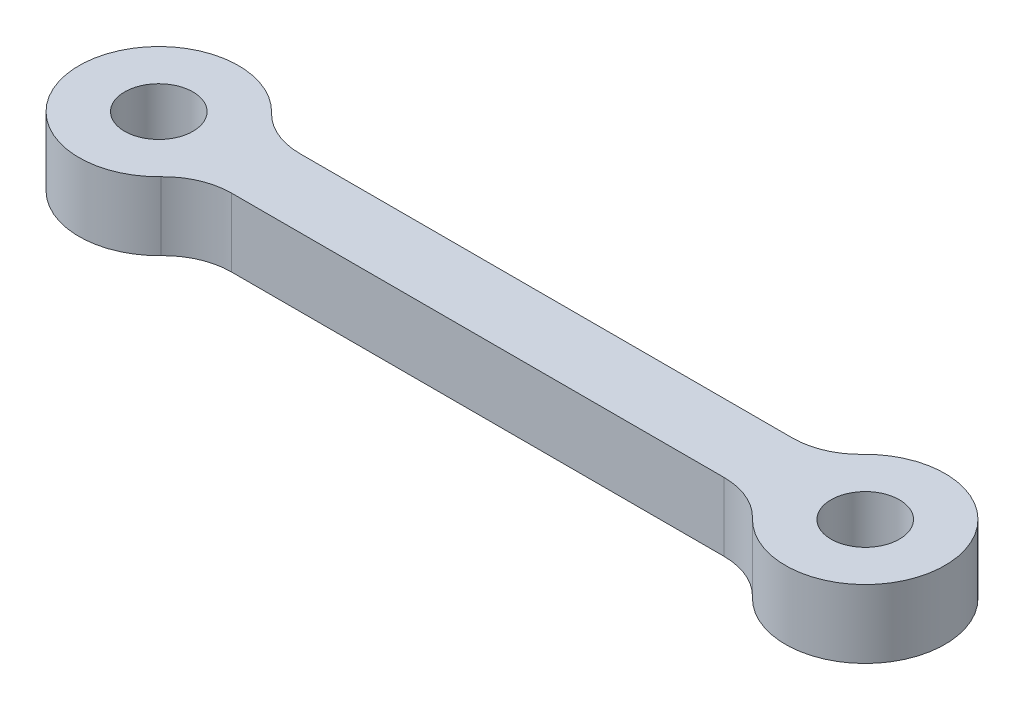
ISO-10303-21;
HEADER;
FILE_DESCRIPTION(('STEP AP214'),'2;1');
FILE_NAME('part.step','',(''),(''),'','','');
FILE_SCHEMA(('AUTOMOTIVE_DESIGN { 1 0 10303 214 1 1 1 1 }'));
ENDSEC;
DATA;
#1=APPLICATION_CONTEXT('core data for automotive mechanical design processes');
#2=APPLICATION_PROTOCOL_DEFINITION('international standard','automotive_design',2000,#1);
#3=PRODUCT_CONTEXT('',#1,'mechanical');
#4=PRODUCT('Part','Part','',(#3));
#5=PRODUCT_RELATED_PRODUCT_CATEGORY('part','',(#4));
#6=PRODUCT_DEFINITION_FORMATION('','',#4);
#7=PRODUCT_DEFINITION_CONTEXT('part definition',#1,'design');
#8=PRODUCT_DEFINITION('design','',#6,#7);
#9=PRODUCT_DEFINITION_SHAPE('','',#8);
#10=(LENGTH_UNIT() NAMED_UNIT(*) SI_UNIT(.MILLI.,.METRE.));
#11=(NAMED_UNIT(*) PLANE_ANGLE_UNIT() SI_UNIT($,.RADIAN.));
#12=(NAMED_UNIT(*) SI_UNIT($,.STERADIAN.) SOLID_ANGLE_UNIT());
#13=UNCERTAINTY_MEASURE_WITH_UNIT(LENGTH_MEASURE(1.E-05),#10,'distance_accuracy_value','');
#14=(GEOMETRIC_REPRESENTATION_CONTEXT(3) GLOBAL_UNCERTAINTY_ASSIGNED_CONTEXT((#13)) GLOBAL_UNIT_ASSIGNED_CONTEXT((#10,
#11,#12)) REPRESENTATION_CONTEXT('',''));
#15=CARTESIAN_POINT('',(0.,0.,0.));
#16=DIRECTION('',(0.,0.,1.));
#17=DIRECTION('',(1.,0.,0.));
#18=AXIS2_PLACEMENT_3D('',#15,#16,#17);
#19=CARTESIAN_POINT('',(0.,1.5,-1.5));
#20=DIRECTION('',(0.,0.,-1.));
#21=DIRECTION('',(-1.,0.,0.));
#22=AXIS2_PLACEMENT_3D('',#19,#20,#21);
#23=PLANE('',#22);
#24=DIRECTION('',(1.,0.,0.));
#25=VECTOR('',#24,1.);
#26=CARTESIAN_POINT('',(0.,-1.5,-1.5));
#27=LINE('',#26,#25);
#28=CARTESIAN_POINT('',(-10.8095842401766,-1.5,-1.5));
#29=VERTEX_POINT('',#28);
#30=CARTESIAN_POINT('',(10.8095842401766,-1.5,-1.5));
#31=VERTEX_POINT('',#30);
#32=EDGE_CURVE('E123',#29,#31,#27,.T.);
#33=ORIENTED_EDGE('',*,*,#32,.F.);
#34=DIRECTION('',(0.,-1.,0.));
#35=VECTOR('',#34,1.);
#36=CARTESIAN_POINT('',(-10.8095842401766,1.5,-1.5));
#37=LINE('',#36,#35);
#38=CARTESIAN_POINT('',(-10.8095842401766,1.5,-1.5));
#39=VERTEX_POINT('',#38);
#40=EDGE_CURVE('E102',#29,#39,#37,.F.);
#41=ORIENTED_EDGE('',*,*,#40,.T.);
#42=DIRECTION('',(1.,0.,0.));
#43=VECTOR('',#42,1.);
#44=CARTESIAN_POINT('',(0.,1.5,-1.5));
#45=LINE('',#44,#43);
#46=CARTESIAN_POINT('',(10.8095842401766,1.5,-1.5));
#47=VERTEX_POINT('',#46);
#48=EDGE_CURVE('E138',#39,#47,#45,.T.);
#49=ORIENTED_EDGE('',*,*,#48,.T.);
#50=DIRECTION('',(0.,-1.,0.));
#51=VECTOR('',#50,1.);
#52=CARTESIAN_POINT('',(10.8095842401766,1.5,-1.5));
#53=LINE('',#52,#51);
#54=EDGE_CURVE('E116',#47,#31,#53,.T.);
#55=ORIENTED_EDGE('',*,*,#54,.T.);
#56=EDGE_LOOP('',(#33,#41,#49,#55));
#57=FACE_BOUND('',#56,.T.);
#58=ADVANCED_FACE('F32',(#57),#23,.T.);
#59=CARTESIAN_POINT('',(-15.5,1.5,0.));
#60=DIRECTION('',(0.,-1.,0.));
#61=DIRECTION('',(0.,0.,-1.));
#62=AXIS2_PLACEMENT_3D('',#59,#60,#61);
#63=CYLINDRICAL_SURFACE('',#62,3.5);
#64=CARTESIAN_POINT('',(-15.5,1.5,0.));
#65=DIRECTION('',(0.,1.,0.));
#66=DIRECTION('',(0.,0.,1.));
#67=AXIS2_PLACEMENT_3D('',#64,#65,#66);
#68=CIRCLE('',#67,3.5);
#69=CARTESIAN_POINT('',(-12.9743915139412,1.5,-2.42307692307692));
#70=VERTEX_POINT('',#69);
#71=CARTESIAN_POINT('',(-12.9743915139412,1.5,2.42307692307692));
#72=VERTEX_POINT('',#71);
#73=EDGE_CURVE('E115',#70,#72,#68,.T.);
#74=ORIENTED_EDGE('',*,*,#73,.F.);
#75=DIRECTION('',(0.,-1.,0.));
#76=VECTOR('',#75,1.);
#77=CARTESIAN_POINT('',(-12.9743915139412,1.5,-2.42307692307692));
#78=LINE('',#77,#76);
#79=CARTESIAN_POINT('',(-12.9743915139412,-1.5,-2.42307692307692));
#80=VERTEX_POINT('',#79);
#81=EDGE_CURVE('E101',#70,#80,#78,.T.);
#82=ORIENTED_EDGE('',*,*,#81,.T.);
#83=CARTESIAN_POINT('',(-15.5,-1.5,0.));
#84=DIRECTION('',(0.,1.,0.));
#85=DIRECTION('',(0.,0.,1.));
#86=AXIS2_PLACEMENT_3D('',#83,#84,#85);
#87=CIRCLE('',#86,3.5);
#88=CARTESIAN_POINT('',(-12.9743915139412,-1.5,2.42307692307692));
#89=VERTEX_POINT('',#88);
#90=EDGE_CURVE('E113',#80,#89,#87,.T.);
#91=ORIENTED_EDGE('',*,*,#90,.T.);
#92=DIRECTION('',(0.,-1.,0.));
#93=VECTOR('',#92,1.);
#94=CARTESIAN_POINT('',(-12.9743915139412,1.5,2.42307692307692));
#95=LINE('',#94,#93);
#96=EDGE_CURVE('E117',#89,#72,#95,.F.);
#97=ORIENTED_EDGE('',*,*,#96,.T.);
#98=EDGE_LOOP('',(#74,#82,#91,#97));
#99=FACE_BOUND('',#98,.T.);
#100=ADVANCED_FACE('F112',(#99),#63,.T.);
#101=CARTESIAN_POINT('',(0.,1.5,1.5));
#102=DIRECTION('',(0.,0.,-1.));
#103=DIRECTION('',(-1.,0.,0.));
#104=AXIS2_PLACEMENT_3D('',#101,#102,#103);
#105=PLANE('',#104);
#106=DIRECTION('',(1.,0.,0.));
#107=VECTOR('',#106,1.);
#108=CARTESIAN_POINT('',(0.,-1.5,1.5));
#109=LINE('',#108,#107);
#110=CARTESIAN_POINT('',(-10.8095842401766,-1.5,1.5));
#111=VERTEX_POINT('',#110);
#112=CARTESIAN_POINT('',(10.8095842401766,-1.5,1.5));
#113=VERTEX_POINT('',#112);
#114=EDGE_CURVE('E122',#111,#113,#109,.T.);
#115=ORIENTED_EDGE('',*,*,#114,.T.);
#116=DIRECTION('',(0.,1.,0.));
#117=VECTOR('',#116,1.);
#118=CARTESIAN_POINT('',(10.8095842401766,1.5,1.5));
#119=LINE('',#118,#117);
#120=CARTESIAN_POINT('',(10.8095842401766,1.5,1.5));
#121=VERTEX_POINT('',#120);
#122=EDGE_CURVE('E47',#113,#121,#119,.T.);
#123=ORIENTED_EDGE('',*,*,#122,.T.);
#124=DIRECTION('',(1.,0.,0.));
#125=VECTOR('',#124,1.);
#126=CARTESIAN_POINT('',(0.,1.5,1.5));
#127=LINE('',#126,#125);
#128=CARTESIAN_POINT('',(-10.8095842401766,1.5,1.5));
#129=VERTEX_POINT('',#128);
#130=EDGE_CURVE('E169',#129,#121,#127,.T.);
#131=ORIENTED_EDGE('',*,*,#130,.F.);
#132=DIRECTION('',(0.,1.,0.));
#133=VECTOR('',#132,1.);
#134=CARTESIAN_POINT('',(-10.8095842401766,-1.5,1.5));
#135=LINE('',#134,#133);
#136=EDGE_CURVE('E149',#129,#111,#135,.F.);
#137=ORIENTED_EDGE('',*,*,#136,.T.);
#138=EDGE_LOOP('',(#115,#123,#131,#137));
#139=FACE_BOUND('',#138,.T.);
#140=ADVANCED_FACE('F179',(#139),#105,.F.);
#141=CARTESIAN_POINT('',(15.5,1.5,0.));
#142=DIRECTION('',(0.,-1.,0.));
#143=DIRECTION('',(0.,0.,-1.));
#144=AXIS2_PLACEMENT_3D('',#141,#142,#143);
#145=CYLINDRICAL_SURFACE('',#144,1.5);
#146=CARTESIAN_POINT('',(15.5,1.5,0.));
#147=DIRECTION('',(0.,1.,0.));
#148=DIRECTION('',(0.,0.,1.));
#149=AXIS2_PLACEMENT_3D('',#146,#147,#148);
#150=CIRCLE('',#149,1.5);
#151=CARTESIAN_POINT('',(15.5,1.5,1.5));
#152=VERTEX_POINT('',#151);
#153=EDGE_CURVE('E176',#152,#152,#150,.T.);
#154=ORIENTED_EDGE('',*,*,#153,.T.);
#155=EDGE_LOOP('',(#154));
#156=FACE_BOUND('',#155,.T.);
#157=CARTESIAN_POINT('',(15.5,-1.5,0.));
#158=DIRECTION('',(0.,1.,0.));
#159=DIRECTION('',(0.,0.,1.));
#160=AXIS2_PLACEMENT_3D('',#157,#158,#159);
#161=CIRCLE('',#160,1.5);
#162=CARTESIAN_POINT('',(15.5,-1.5,1.5));
#163=VERTEX_POINT('',#162);
#164=EDGE_CURVE('E132',#163,#163,#161,.T.);
#165=ORIENTED_EDGE('',*,*,#164,.F.);
#166=EDGE_LOOP('',(#165));
#167=FACE_BOUND('',#166,.T.);
#168=ADVANCED_FACE('F260',(#156,#167),#145,.F.);
#169=CARTESIAN_POINT('',(15.5,1.5,0.));
#170=DIRECTION('',(0.,-1.,0.));
#171=DIRECTION('',(0.,0.,-1.));
#172=AXIS2_PLACEMENT_3D('',#169,#170,#171);
#173=CYLINDRICAL_SURFACE('',#172,3.5);
#174=CARTESIAN_POINT('',(15.5,-1.5,0.));
#175=DIRECTION('',(0.,1.,0.));
#176=DIRECTION('',(0.,0.,1.));
#177=AXIS2_PLACEMENT_3D('',#174,#175,#176);
#178=CIRCLE('',#177,3.5);
#179=CARTESIAN_POINT('',(12.9743915139412,-1.5,2.42307692307692));
#180=VERTEX_POINT('',#179);
#181=CARTESIAN_POINT('',(12.9743915139412,-1.5,-2.42307692307692));
#182=VERTEX_POINT('',#181);
#183=EDGE_CURVE('E125',#180,#182,#178,.T.);
#184=ORIENTED_EDGE('',*,*,#183,.T.);
#185=DIRECTION('',(0.,-1.,0.));
#186=VECTOR('',#185,1.);
#187=CARTESIAN_POINT('',(12.9743915139412,1.5,-2.42307692307692));
#188=LINE('',#187,#186);
#189=CARTESIAN_POINT('',(12.9743915139412,1.5,-2.42307692307692));
#190=VERTEX_POINT('',#189);
#191=EDGE_CURVE('E147',#182,#190,#188,.F.);
#192=ORIENTED_EDGE('',*,*,#191,.T.);
#193=CARTESIAN_POINT('',(15.5,1.5,0.));
#194=DIRECTION('',(0.,1.,0.));
#195=DIRECTION('',(0.,0.,1.));
#196=AXIS2_PLACEMENT_3D('',#193,#194,#195);
#197=CIRCLE('',#196,3.5);
#198=CARTESIAN_POINT('',(12.9743915139412,1.5,2.42307692307692));
#199=VERTEX_POINT('',#198);
#200=EDGE_CURVE('E167',#199,#190,#197,.T.);
#201=ORIENTED_EDGE('',*,*,#200,.F.);
#202=DIRECTION('',(0.,-1.,0.));
#203=VECTOR('',#202,1.);
#204=CARTESIAN_POINT('',(12.9743915139412,1.5,2.42307692307692));
#205=LINE('',#204,#203);
#206=EDGE_CURVE('E144',#199,#180,#205,.T.);
#207=ORIENTED_EDGE('',*,*,#206,.T.);
#208=EDGE_LOOP('',(#184,#192,#201,#207));
#209=FACE_BOUND('',#208,.T.);
#210=ADVANCED_FACE('F173',(#209),#173,.T.);
#211=CARTESIAN_POINT('',(-15.5,1.5,0.));
#212=DIRECTION('',(0.,-1.,0.));
#213=DIRECTION('',(0.,0.,-1.));
#214=AXIS2_PLACEMENT_3D('',#211,#212,#213);
#215=CYLINDRICAL_SURFACE('',#214,1.5);
#216=CARTESIAN_POINT('',(-15.5,1.5,0.));
#217=DIRECTION('',(0.,1.,0.));
#218=DIRECTION('',(0.,0.,1.));
#219=AXIS2_PLACEMENT_3D('',#216,#217,#218);
#220=CIRCLE('',#219,1.5);
#221=CARTESIAN_POINT('',(-15.5,1.5,1.5));
#222=VERTEX_POINT('',#221);
#223=EDGE_CURVE('E139',#222,#222,#220,.T.);
#224=ORIENTED_EDGE('',*,*,#223,.T.);
#225=EDGE_LOOP('',(#224));
#226=FACE_BOUND('',#225,.T.);
#227=CARTESIAN_POINT('',(-15.5,-1.5,0.));
#228=DIRECTION('',(0.,1.,0.));
#229=DIRECTION('',(0.,0.,1.));
#230=AXIS2_PLACEMENT_3D('',#227,#228,#229);
#231=CIRCLE('',#230,1.5);
#232=CARTESIAN_POINT('',(-15.5,-1.5,1.5));
#233=VERTEX_POINT('',#232);
#234=EDGE_CURVE('E135',#233,#233,#231,.T.);
#235=ORIENTED_EDGE('',*,*,#234,.F.);
#236=EDGE_LOOP('',(#235));
#237=FACE_BOUND('',#236,.T.);
#238=ADVANCED_FACE('F191',(#226,#237),#215,.F.);
#239=CARTESIAN_POINT('',(0.,1.5,0.));
#240=DIRECTION('',(0.,1.,0.));
#241=DIRECTION('',(0.,0.,1.));
#242=AXIS2_PLACEMENT_3D('',#239,#240,#241);
#243=PLANE('',#242);
#244=ORIENTED_EDGE('',*,*,#48,.F.);
#245=CARTESIAN_POINT('',(-10.8095842401766,1.5,-4.5));
#246=DIRECTION('',(0.,1.,0.));
#247=DIRECTION('',(0.,0.,1.));
#248=AXIS2_PLACEMENT_3D('',#245,#246,#247);
#249=CIRCLE('',#248,3.);
#250=EDGE_CURVE('E107',#39,#70,#249,.F.);
#251=ORIENTED_EDGE('',*,*,#250,.T.);
#252=ORIENTED_EDGE('',*,*,#73,.T.);
#253=CARTESIAN_POINT('',(-10.8095842401766,1.5,4.5));
#254=DIRECTION('',(0.,1.,0.));
#255=DIRECTION('',(0.,0.,1.));
#256=AXIS2_PLACEMENT_3D('',#253,#254,#255);
#257=CIRCLE('',#256,3.);
#258=EDGE_CURVE('E11',#72,#129,#257,.F.);
#259=ORIENTED_EDGE('',*,*,#258,.T.);
#260=ORIENTED_EDGE('',*,*,#130,.T.);
#261=CARTESIAN_POINT('',(10.8095842401766,1.5,4.5));
#262=DIRECTION('',(0.,1.,0.));
#263=DIRECTION('',(0.,0.,1.));
#264=AXIS2_PLACEMENT_3D('',#261,#262,#263);
#265=CIRCLE('',#264,3.);
#266=EDGE_CURVE('E160',#121,#199,#265,.F.);
#267=ORIENTED_EDGE('',*,*,#266,.T.);
#268=ORIENTED_EDGE('',*,*,#200,.T.);
#269=CARTESIAN_POINT('',(10.8095842401766,1.5,-4.5));
#270=DIRECTION('',(0.,1.,0.));
#271=DIRECTION('',(0.,0.,1.));
#272=AXIS2_PLACEMENT_3D('',#269,#270,#271);
#273=CIRCLE('',#272,3.);
#274=EDGE_CURVE('E156',#190,#47,#273,.F.);
#275=ORIENTED_EDGE('',*,*,#274,.T.);
#276=EDGE_LOOP('',(#244,#251,#252,#259,#260,#267,#268,#275));
#277=FACE_BOUND('',#276,.T.);
#278=ORIENTED_EDGE('',*,*,#153,.F.);
#279=EDGE_LOOP('',(#278));
#280=FACE_BOUND('',#279,.T.);
#281=ORIENTED_EDGE('',*,*,#223,.F.);
#282=EDGE_LOOP('',(#281));
#283=FACE_BOUND('',#282,.T.);
#284=ADVANCED_FACE('F165',(#277,#280,#283),#243,.T.);
#285=CARTESIAN_POINT('',(0.,-1.5,0.));
#286=DIRECTION('',(0.,1.,0.));
#287=DIRECTION('',(0.,0.,1.));
#288=AXIS2_PLACEMENT_3D('',#285,#286,#287);
#289=PLANE('',#288);
#290=ORIENTED_EDGE('',*,*,#90,.F.);
#291=CARTESIAN_POINT('',(-10.8095842401766,-1.5,-4.5));
#292=DIRECTION('',(0.,1.,0.));
#293=DIRECTION('',(0.,0.,1.));
#294=AXIS2_PLACEMENT_3D('',#291,#292,#293);
#295=CIRCLE('',#294,3.);
#296=EDGE_CURVE('E97',#80,#29,#295,.T.);
#297=ORIENTED_EDGE('',*,*,#296,.T.);
#298=ORIENTED_EDGE('',*,*,#32,.T.);
#299=CARTESIAN_POINT('',(10.8095842401766,-1.5,-4.5));
#300=DIRECTION('',(0.,1.,0.));
#301=DIRECTION('',(0.,0.,1.));
#302=AXIS2_PLACEMENT_3D('',#299,#300,#301);
#303=CIRCLE('',#302,3.);
#304=EDGE_CURVE('E154',#31,#182,#303,.T.);
#305=ORIENTED_EDGE('',*,*,#304,.T.);
#306=ORIENTED_EDGE('',*,*,#183,.F.);
#307=CARTESIAN_POINT('',(10.8095842401766,-1.5,4.5));
#308=DIRECTION('',(0.,1.,0.));
#309=DIRECTION('',(0.,0.,1.));
#310=AXIS2_PLACEMENT_3D('',#307,#308,#309);
#311=CIRCLE('',#310,3.);
#312=EDGE_CURVE('E158',#180,#113,#311,.T.);
#313=ORIENTED_EDGE('',*,*,#312,.T.);
#314=ORIENTED_EDGE('',*,*,#114,.F.);
#315=CARTESIAN_POINT('',(-10.8095842401766,-1.5,4.5));
#316=DIRECTION('',(0.,1.,0.));
#317=DIRECTION('',(0.,0.,1.));
#318=AXIS2_PLACEMENT_3D('',#315,#316,#317);
#319=CIRCLE('',#318,3.);
#320=EDGE_CURVE('E40',#111,#89,#319,.T.);
#321=ORIENTED_EDGE('',*,*,#320,.T.);
#322=EDGE_LOOP('',(#290,#297,#298,#305,#306,#313,#314,#321));
#323=FACE_BOUND('',#322,.T.);
#324=ORIENTED_EDGE('',*,*,#164,.T.);
#325=EDGE_LOOP('',(#324));
#326=FACE_BOUND('',#325,.T.);
#327=ORIENTED_EDGE('',*,*,#234,.T.);
#328=EDGE_LOOP('',(#327));
#329=FACE_BOUND('',#328,.T.);
#330=ADVANCED_FACE('F119',(#323,#326,#329),#289,.F.);
#331=CARTESIAN_POINT('',(-10.8095842401766,1.5,-4.5));
#332=DIRECTION('',(0.,-1.,0.));
#333=DIRECTION('',(0.,0.,-1.));
#334=AXIS2_PLACEMENT_3D('',#331,#332,#333);
#335=CYLINDRICAL_SURFACE('',#334,3.);
#336=ORIENTED_EDGE('',*,*,#250,.F.);
#337=ORIENTED_EDGE('',*,*,#40,.F.);
#338=ORIENTED_EDGE('',*,*,#296,.F.);
#339=ORIENTED_EDGE('',*,*,#81,.F.);
#340=EDGE_LOOP('',(#336,#337,#338,#339));
#341=FACE_BOUND('',#340,.T.);
#342=ADVANCED_FACE('F100',(#341),#335,.F.);
#343=CARTESIAN_POINT('',(10.8095842401766,1.5,-4.5));
#344=DIRECTION('',(0.,-1.,0.));
#345=DIRECTION('',(0.,0.,-1.));
#346=AXIS2_PLACEMENT_3D('',#343,#344,#345);
#347=CYLINDRICAL_SURFACE('',#346,3.);
#348=ORIENTED_EDGE('',*,*,#274,.F.);
#349=ORIENTED_EDGE('',*,*,#191,.F.);
#350=ORIENTED_EDGE('',*,*,#304,.F.);
#351=ORIENTED_EDGE('',*,*,#54,.F.);
#352=EDGE_LOOP('',(#348,#349,#350,#351));
#353=FACE_BOUND('',#352,.T.);
#354=ADVANCED_FACE('F213',(#353),#347,.F.);
#355=CARTESIAN_POINT('',(10.8095842401766,1.5,4.5));
#356=DIRECTION('',(0.,-1.,0.));
#357=DIRECTION('',(0.,0.,-1.));
#358=AXIS2_PLACEMENT_3D('',#355,#356,#357);
#359=CYLINDRICAL_SURFACE('',#358,3.);
#360=ORIENTED_EDGE('',*,*,#266,.F.);
#361=ORIENTED_EDGE('',*,*,#122,.F.);
#362=ORIENTED_EDGE('',*,*,#312,.F.);
#363=ORIENTED_EDGE('',*,*,#206,.F.);
#364=EDGE_LOOP('',(#360,#361,#362,#363));
#365=FACE_BOUND('',#364,.T.);
#366=ADVANCED_FACE('F178',(#365),#359,.F.);
#367=CARTESIAN_POINT('',(-10.8095842401766,1.5,4.5));
#368=DIRECTION('',(0.,-1.,0.));
#369=DIRECTION('',(0.,0.,-1.));
#370=AXIS2_PLACEMENT_3D('',#367,#368,#369);
#371=CYLINDRICAL_SURFACE('',#370,3.);
#372=ORIENTED_EDGE('',*,*,#258,.F.);
#373=ORIENTED_EDGE('',*,*,#96,.F.);
#374=ORIENTED_EDGE('',*,*,#320,.F.);
#375=ORIENTED_EDGE('',*,*,#136,.F.);
#376=EDGE_LOOP('',(#372,#373,#374,#375));
#377=FACE_BOUND('',#376,.T.);
#378=ADVANCED_FACE('F34',(#377),#371,.F.);
#379=CLOSED_SHELL('',(#58,#100,#140,#168,#210,#238,#284,#330,#342,#354,#366,#378));
#380=MANIFOLD_SOLID_BREP('B2',#379);
#381=ADVANCED_BREP_SHAPE_REPRESENTATION('',(#18,#380),#14);
#382=SHAPE_DEFINITION_REPRESENTATION(#9,#381);
ENDSEC;
END-ISO-10303-21;
